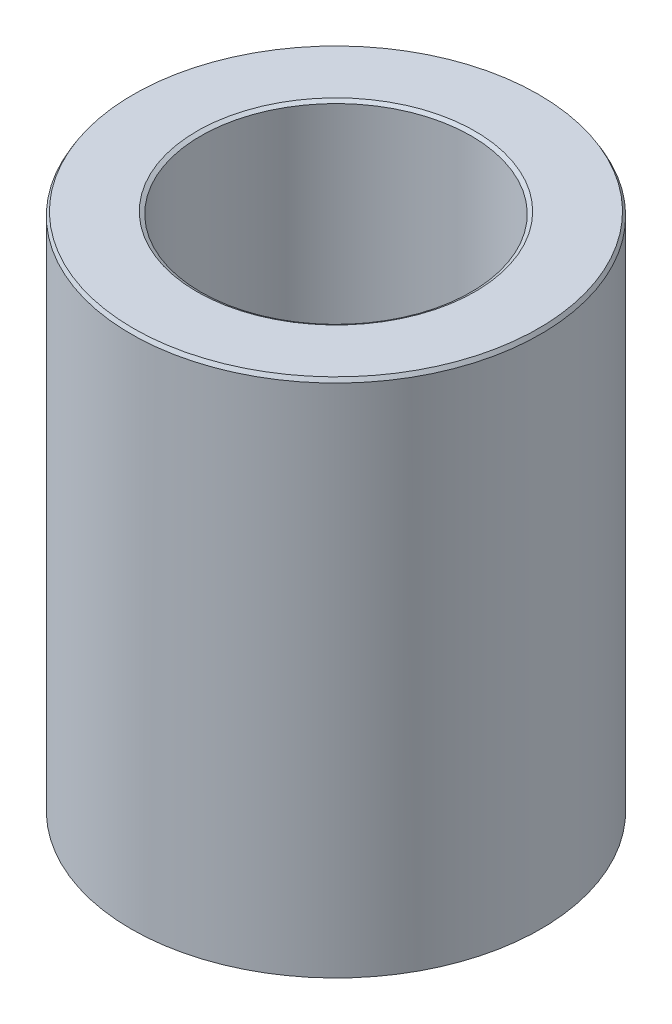
ISO-10303-21;
HEADER;
FILE_DESCRIPTION(('STEP AP214'),'2;1');
FILE_NAME('part.step','',(''),(''),'','','');
FILE_SCHEMA(('AUTOMOTIVE_DESIGN { 1 0 10303 214 1 1 1 1 }'));
ENDSEC;
DATA;
#1=APPLICATION_CONTEXT('core data for automotive mechanical design processes');
#2=APPLICATION_PROTOCOL_DEFINITION('international standard','automotive_design',2000,#1);
#3=PRODUCT_CONTEXT('',#1,'mechanical');
#4=PRODUCT('Part','Part','',(#3));
#5=PRODUCT_RELATED_PRODUCT_CATEGORY('part','',(#4));
#6=PRODUCT_DEFINITION_FORMATION('','',#4);
#7=PRODUCT_DEFINITION_CONTEXT('part definition',#1,'design');
#8=PRODUCT_DEFINITION('design','',#6,#7);
#9=PRODUCT_DEFINITION_SHAPE('','',#8);
#10=(LENGTH_UNIT() NAMED_UNIT(*) SI_UNIT(.MILLI.,.METRE.));
#11=(NAMED_UNIT(*) PLANE_ANGLE_UNIT() SI_UNIT($,.RADIAN.));
#12=(NAMED_UNIT(*) SI_UNIT($,.STERADIAN.) SOLID_ANGLE_UNIT());
#13=UNCERTAINTY_MEASURE_WITH_UNIT(LENGTH_MEASURE(1.E-05),#10,'distance_accuracy_value','');
#14=(GEOMETRIC_REPRESENTATION_CONTEXT(3) GLOBAL_UNCERTAINTY_ASSIGNED_CONTEXT((#13)) GLOBAL_UNIT_ASSIGNED_CONTEXT((#10,
#11,#12)) REPRESENTATION_CONTEXT('',''));
#15=CARTESIAN_POINT('',(0.,0.,0.));
#16=DIRECTION('',(0.,0.,1.));
#17=DIRECTION('',(1.,0.,0.));
#18=AXIS2_PLACEMENT_3D('',#15,#16,#17);
#19=CARTESIAN_POINT('',(0.,101.789191785078,0.));
#20=DIRECTION('',(0.,-1.,0.));
#21=DIRECTION('',(0.,0.,-1.));
#22=AXIS2_PLACEMENT_3D('',#19,#20,#21);
#23=CYLINDRICAL_SURFACE('',#22,40.);
#24=CARTESIAN_POINT('',(0.,0.432289931129648,0.));
#25=DIRECTION('',(0.,1.,0.));
#26=DIRECTION('',(0.,0.,1.));
#27=AXIS2_PLACEMENT_3D('',#24,#25,#26);
#28=CIRCLE('',#27,40.);
#29=CARTESIAN_POINT('',(0.,0.432289931129634,-40.));
#30=VERTEX_POINT('',#29);
#31=EDGE_CURVE('E10',#30,#30,#28,.T.);
#32=CARTESIAN_POINT('',(0.,101.040443660761,0.));
#33=DIRECTION('',(0.,1.,0.));
#34=DIRECTION('',(0.,0.,1.));
#35=AXIS2_PLACEMENT_3D('',#32,#33,#34);
#36=CIRCLE('',#35,40.);
#37=CARTESIAN_POINT('',(0.,101.040443660761,-40.));
#38=VERTEX_POINT('',#37);
#39=EDGE_CURVE('E50',#38,#38,#36,.F.);
#40=CARTESIAN_POINT('',(0.,0.432289931129634,-40.));
#41=CARTESIAN_POINT('',(0.,1.48029153247996,-40.));
#42=CARTESIAN_POINT('',(0.,2.52829313383029,-40.));
#43=CARTESIAN_POINT('',(0.,4.62429633653095,-40.));
#44=CARTESIAN_POINT('',(0.,5.67229793788128,-40.));
#45=CARTESIAN_POINT('',(0.,7.76830114058193,-40.));
#46=CARTESIAN_POINT('',(0.,8.81630274193225,-40.));
#47=CARTESIAN_POINT('',(0.,10.9123059446329,-40.));
#48=CARTESIAN_POINT('',(0.,11.9603075459832,-40.));
#49=CARTESIAN_POINT('',(0.,14.0563107486839,-40.));
#50=CARTESIAN_POINT('',(0.,15.1043123500342,-40.));
#51=CARTESIAN_POINT('',(0.,17.2003155527349,-40.));
#52=CARTESIAN_POINT('',(0.,18.2483171540852,-40.));
#53=CARTESIAN_POINT('',(0.,20.3443203567859,-40.));
#54=CARTESIAN_POINT('',(0.,21.3923219581362,-40.));
#55=CARTESIAN_POINT('',(0.,23.4883251608368,-40.));
#56=CARTESIAN_POINT('',(0.,24.5363267621872,-40.));
#57=CARTESIAN_POINT('',(0.,26.6323299648878,-40.));
#58=CARTESIAN_POINT('',(0.,27.6803315662381,-40.));
#59=CARTESIAN_POINT('',(0.,29.7763347689388,-40.));
#60=CARTESIAN_POINT('',(0.,30.8243363702891,-40.));
#61=CARTESIAN_POINT('',(0.,32.9203395729898,-40.));
#62=CARTESIAN_POINT('',(0.,33.9683411743401,-40.));
#63=CARTESIAN_POINT('',(0.,36.0643443770408,-40.));
#64=CARTESIAN_POINT('',(0.,37.1123459783911,-40.));
#65=CARTESIAN_POINT('',(0.,39.2083491810917,-40.));
#66=CARTESIAN_POINT('',(0.,40.2563507824421,-40.));
#67=CARTESIAN_POINT('',(0.,42.3523539851427,-40.));
#68=CARTESIAN_POINT('',(0.,43.400355586493,-40.));
#69=CARTESIAN_POINT('',(0.,45.4963587891937,-40.));
#70=CARTESIAN_POINT('',(0.,46.544360390544,-40.));
#71=CARTESIAN_POINT('',(0.,48.6403635932447,-40.));
#72=CARTESIAN_POINT('',(0.,49.688365194595,-40.));
#73=CARTESIAN_POINT('',(0.,51.7843683972957,-40.));
#74=CARTESIAN_POINT('',(0.,52.832369998646,-40.));
#75=CARTESIAN_POINT('',(0.,54.9283732013466,-40.));
#76=CARTESIAN_POINT('',(0.,55.976374802697,-40.));
#77=CARTESIAN_POINT('',(0.,58.0723780053976,-40.));
#78=CARTESIAN_POINT('',(0.,59.120379606748,-40.));
#79=CARTESIAN_POINT('',(0.,61.2163828094486,-40.));
#80=CARTESIAN_POINT('',(0.,62.2643844107989,-40.));
#81=CARTESIAN_POINT('',(0.,64.3603876134996,-40.));
#82=CARTESIAN_POINT('',(0.,65.4083892148499,-40.));
#83=CARTESIAN_POINT('',(0.,67.5043924175506,-40.));
#84=CARTESIAN_POINT('',(0.,68.5523940189009,-40.));
#85=CARTESIAN_POINT('',(0.,70.6483972216015,-40.));
#86=CARTESIAN_POINT('',(0.,71.6963988229519,-40.));
#87=CARTESIAN_POINT('',(0.,73.7924020256525,-40.));
#88=CARTESIAN_POINT('',(0.,74.8404036270029,-40.));
#89=CARTESIAN_POINT('',(0.,76.9364068297035,-40.));
#90=CARTESIAN_POINT('',(0.,77.9844084310538,-40.));
#91=CARTESIAN_POINT('',(0.,80.0804116337545,-40.));
#92=CARTESIAN_POINT('',(0.,81.1284132351048,-40.));
#93=CARTESIAN_POINT('',(0.,83.2244164378055,-40.));
#94=CARTESIAN_POINT('',(0.,84.2724180391558,-40.));
#95=CARTESIAN_POINT('',(0.,86.3684212418565,-40.));
#96=CARTESIAN_POINT('',(0.,87.4164228432068,-40.));
#97=CARTESIAN_POINT('',(0.,89.5124260459074,-40.));
#98=CARTESIAN_POINT('',(0.,90.5604276472578,-40.));
#99=CARTESIAN_POINT('',(0.,92.6564308499584,-40.));
#100=CARTESIAN_POINT('',(0.,93.7044324513087,-40.));
#101=CARTESIAN_POINT('',(0.,95.8004356540094,-40.));
#102=CARTESIAN_POINT('',(0.,96.8484372553597,-40.));
#103=CARTESIAN_POINT('',(0.,98.9444404580604,-40.));
#104=CARTESIAN_POINT('',(0.,99.9924420594107,-40.));
#105=CARTESIAN_POINT('',(0.,101.040443660761,-40.));
#106=B_SPLINE_CURVE_WITH_KNOTS('',3,(#40,#41,#42,#43,#44,#45,#46,#47,#48,#49,#50,#51,#52,#53,
#54,#55,#56,#57,#58,#59,#60,#61,#62,#63,#64,#65,#66,#67,#68,#69,#70,#71,#72,#73,#74,#75,#76,#77,
#78,#79,#80,#81,#82,#83,#84,#85,#86,#87,#88,#89,#90,#91,#92,#93,#94,#95,#96,#97,#98,#99,#100,
#101,#102,#103,#104,#105),.UNSPECIFIED.,.F.,.F.,(4,2,2,2,2,2,2,2,2,2,2,2,2,2,2,2,2,2,2,2,2,2,2,
2,2,2,2,2,2,2,2,2,4),(0.,3.14400480405098,6.28800960810197,9.43201441215294,12.5760192162039,
15.7200240202549,18.8640288243059,22.0080336283569,25.1520384324078,28.2960432364588,
31.4400480405098,34.5840528445608,37.7280576486118,40.8720624526628,44.0160672567137,
47.1600720607647,50.3040768648157,53.4480816688667,56.5920864729177,59.7360912769687,
62.8800960810196,66.0241008850706,69.1681056891216,72.3121104931726,75.4561152972236,
78.6001201012745,81.7441249053255,84.8881297093765,88.0321345134275,91.1761393174785,
94.3201441215294,97.4641489255804,100.608153729631),.UNSPECIFIED.);
#107=EDGE_CURVE('BSEAM39',#30,#38,#106,.T.);
#108=ORIENTED_EDGE('',*,*,#31,.T.);
#109=ORIENTED_EDGE('',*,*,#39,.T.);
#110=ORIENTED_EDGE('',*,*,#107,.T.);
#111=ORIENTED_EDGE('',*,*,#107,.F.);
#112=EDGE_LOOP('',(#108,#110,#109,#111));
#113=FACE_BOUND('',#112,.T.);
#114=ADVANCED_FACE('F39',(#113),#23,.T.);
#115=CARTESIAN_POINT('',(0.,101.789191785078,0.));
#116=DIRECTION('',(0.,1.,0.));
#117=DIRECTION('',(0.,0.,1.));
#118=AXIS2_PLACEMENT_3D('',#115,#116,#117);
#119=PLANE('',#118);
#120=CARTESIAN_POINT('',(0.,101.789191785078,0.));
#121=DIRECTION('',(0.,1.,0.));
#122=DIRECTION('',(0.,0.,1.));
#123=AXIS2_PLACEMENT_3D('',#120,#121,#122);
#124=CIRCLE('',#123,27.1606508670038);
#125=CARTESIAN_POINT('',(0.,101.789191785078,27.1606508670038));
#126=VERTEX_POINT('',#125);
#127=EDGE_CURVE('E58',#126,#126,#124,.F.);
#128=ORIENTED_EDGE('',*,*,#127,.T.);
#129=EDGE_LOOP('',(#128));
#130=FACE_BOUND('',#129,.T.);
#131=CARTESIAN_POINT('',(0.,101.789191785078,0.));
#132=DIRECTION('',(0.,1.,0.));
#133=DIRECTION('',(0.,0.,1.));
#134=AXIS2_PLACEMENT_3D('',#131,#132,#133);
#135=CIRCLE('',#134,39.5677100688705);
#136=CARTESIAN_POINT('',(0.,101.789191785078,39.5677100688705));
#137=VERTEX_POINT('',#136);
#138=EDGE_CURVE('E61',#137,#137,#135,.T.);
#139=ORIENTED_EDGE('',*,*,#138,.T.);
#140=EDGE_LOOP('',(#139));
#141=FACE_BOUND('',#140,.T.);
#142=ADVANCED_FACE('F88',(#130,#141),#119,.T.);
#143=CARTESIAN_POINT('',(0.,0.,0.));
#144=DIRECTION('',(0.,1.,0.));
#145=DIRECTION('',(0.,0.,1.));
#146=AXIS2_PLACEMENT_3D('',#143,#144,#145);
#147=PLANE('',#146);
#148=CARTESIAN_POINT('',(0.,0.,0.));
#149=DIRECTION('',(0.,1.,0.));
#150=DIRECTION('',(0.,0.,1.));
#151=AXIS2_PLACEMENT_3D('',#148,#149,#150);
#152=CIRCLE('',#151,26.8441926738164);
#153=CARTESIAN_POINT('',(0.,0.,26.8441926738164));
#154=VERTEX_POINT('',#153);
#155=EDGE_CURVE('E51',#154,#154,#152,.T.);
#156=ORIENTED_EDGE('',*,*,#155,.T.);
#157=EDGE_LOOP('',(#156));
#158=FACE_BOUND('',#157,.T.);
#159=CARTESIAN_POINT('',(0.,0.,0.));
#160=DIRECTION('',(0.,1.,0.));
#161=DIRECTION('',(0.,0.,1.));
#162=AXIS2_PLACEMENT_3D('',#159,#160,#161);
#163=CIRCLE('',#162,39.251251875683);
#164=CARTESIAN_POINT('',(0.,0.,39.251251875683));
#165=VERTEX_POINT('',#164);
#166=EDGE_CURVE('E54',#165,#165,#163,.F.);
#167=ORIENTED_EDGE('',*,*,#166,.T.);
#168=EDGE_LOOP('',(#167));
#169=FACE_BOUND('',#168,.T.);
#170=ADVANCED_FACE('F83',(#158,#169),#147,.F.);
#171=CARTESIAN_POINT('',(0.,101.789191785078,0.));
#172=DIRECTION('',(0.,-1.,0.));
#173=DIRECTION('',(0.,0.,-1.));
#174=AXIS2_PLACEMENT_3D('',#171,#172,#173);
#175=CYLINDRICAL_SURFACE('',#174,26.4119027426868);
#176=CARTESIAN_POINT('',(0.,101.356901853948,0.));
#177=DIRECTION('',(0.,1.,0.));
#178=DIRECTION('',(0.,0.,1.));
#179=AXIS2_PLACEMENT_3D('',#176,#177,#178);
#180=CIRCLE('',#179,26.4119027426868);
#181=CARTESIAN_POINT('',(0.,101.356901853948,-26.4119027426868));
#182=VERTEX_POINT('',#181);
#183=EDGE_CURVE('E67',#182,#182,#180,.T.);
#184=CARTESIAN_POINT('',(0.,0.748748124316939,0.));
#185=DIRECTION('',(0.,1.,0.));
#186=DIRECTION('',(0.,0.,1.));
#187=AXIS2_PLACEMENT_3D('',#184,#185,#186);
#188=CIRCLE('',#187,26.4119027426868);
#189=CARTESIAN_POINT('',(0.,0.748748124316925,-26.4119027426868));
#190=VERTEX_POINT('',#189);
#191=EDGE_CURVE('E69',#190,#190,#188,.F.);
#192=CARTESIAN_POINT('',(0.,101.356901853948,-26.4119027426868));
#193=CARTESIAN_POINT('',(0.,100.308900252598,-26.4119027426868));
#194=CARTESIAN_POINT('',(0.,99.2608986512475,-26.4119027426868));
#195=CARTESIAN_POINT('',(0.,97.1648954485468,-26.4119027426868));
#196=CARTESIAN_POINT('',(0.,96.1168938471965,-26.4119027426868));
#197=CARTESIAN_POINT('',(0.,94.0208906444959,-26.4119027426868));
#198=CARTESIAN_POINT('',(0.,92.9728890431455,-26.4119027426868));
#199=CARTESIAN_POINT('',(0.,90.8768858404449,-26.4119027426868));
#200=CARTESIAN_POINT('',(0.,89.8288842390945,-26.4119027426868));
#201=CARTESIAN_POINT('',(0.,87.7328810363939,-26.4119027426868));
#202=CARTESIAN_POINT('',(0.,86.6848794350436,-26.4119027426868));
#203=CARTESIAN_POINT('',(0.,84.5888762323429,-26.4119027426868));
#204=CARTESIAN_POINT('',(0.,83.5408746309926,-26.4119027426868));
#205=CARTESIAN_POINT('',(0.,81.444871428292,-26.4119027426868));
#206=CARTESIAN_POINT('',(0.,80.3968698269416,-26.4119027426868));
#207=CARTESIAN_POINT('',(0.,78.300866624241,-26.4119027426868));
#208=CARTESIAN_POINT('',(0.,77.2528650228906,-26.4119027426868));
#209=CARTESIAN_POINT('',(0.,75.15686182019,-26.4119027426868));
#210=CARTESIAN_POINT('',(0.,74.1088602188397,-26.4119027426868));
#211=CARTESIAN_POINT('',(0.,72.012857016139,-26.4119027426868));
#212=CARTESIAN_POINT('',(0.,70.9648554147887,-26.4119027426868));
#213=CARTESIAN_POINT('',(0.,68.868852212088,-26.4119027426868));
#214=CARTESIAN_POINT('',(0.,67.8208506107377,-26.4119027426868));
#215=CARTESIAN_POINT('',(0.,65.7248474080371,-26.4119027426868));
#216=CARTESIAN_POINT('',(0.,64.6768458066868,-26.4119027426868));
#217=CARTESIAN_POINT('',(0.,62.5808426039861,-26.4119027426868));
#218=CARTESIAN_POINT('',(0.,61.5328410026358,-26.4119027426868));
#219=CARTESIAN_POINT('',(0.,59.4368377999351,-26.4119027426868));
#220=CARTESIAN_POINT('',(0.,58.3888361985848,-26.4119027426868));
#221=CARTESIAN_POINT('',(0.,56.2928329958842,-26.4119027426868));
#222=CARTESIAN_POINT('',(0.,55.2448313945338,-26.4119027426868));
#223=CARTESIAN_POINT('',(0.,53.1488281918332,-26.4119027426868));
#224=CARTESIAN_POINT('',(0.,52.1008265904829,-26.4119027426868));
#225=CARTESIAN_POINT('',(0.,50.0048233877822,-26.4119027426868));
#226=CARTESIAN_POINT('',(0.,48.9568217864319,-26.4119027426868));
#227=CARTESIAN_POINT('',(0.,46.8608185837312,-26.4119027426868));
#228=CARTESIAN_POINT('',(0.,45.8128169823809,-26.4119027426868));
#229=CARTESIAN_POINT('',(0.,43.7168137796803,-26.4119027426868));
#230=CARTESIAN_POINT('',(0.,42.6688121783299,-26.4119027426868));
#231=CARTESIAN_POINT('',(0.,40.5728089756293,-26.4119027426868));
#232=CARTESIAN_POINT('',(0.,39.524807374279,-26.4119027426868));
#233=CARTESIAN_POINT('',(0.,37.4288041715783,-26.4119027426868));
#234=CARTESIAN_POINT('',(0.,36.380802570228,-26.4119027426868));
#235=CARTESIAN_POINT('',(0.,34.2847993675273,-26.4119027426868));
#236=CARTESIAN_POINT('',(0.,33.236797766177,-26.4119027426868));
#237=CARTESIAN_POINT('',(0.,31.1407945634763,-26.4119027426868));
#238=CARTESIAN_POINT('',(0.,30.092792962126,-26.4119027426868));
#239=CARTESIAN_POINT('',(0.,27.9967897594254,-26.4119027426868));
#240=CARTESIAN_POINT('',(0.,26.9487881580751,-26.4119027426868));
#241=CARTESIAN_POINT('',(0.,24.8527849553744,-26.4119027426868));
#242=CARTESIAN_POINT('',(0.,23.8047833540241,-26.4119027426868));
#243=CARTESIAN_POINT('',(0.,21.7087801513234,-26.4119027426868));
#244=CARTESIAN_POINT('',(0.,20.6607785499731,-26.4119027426868));
#245=CARTESIAN_POINT('',(0.,18.5647753472725,-26.4119027426868));
#246=CARTESIAN_POINT('',(0.,17.5167737459221,-26.4119027426868));
#247=CARTESIAN_POINT('',(0.,15.4207705432215,-26.4119027426868));
#248=CARTESIAN_POINT('',(0.,14.3727689418712,-26.4119027426868));
#249=CARTESIAN_POINT('',(0.,12.2767657391705,-26.4119027426868));
#250=CARTESIAN_POINT('',(0.,11.2287641378202,-26.4119027426868));
#251=CARTESIAN_POINT('',(0.,9.13276093511953,-26.4119027426868));
#252=CARTESIAN_POINT('',(0.,8.0847593337692,-26.4119027426868));
#253=CARTESIAN_POINT('',(0.,5.98875613106855,-26.4119027426868));
#254=CARTESIAN_POINT('',(0.,4.94075452971822,-26.4119027426868));
#255=CARTESIAN_POINT('',(0.,2.84475132701757,-26.4119027426868));
#256=CARTESIAN_POINT('',(0.,1.79674972566725,-26.4119027426868));
#257=CARTESIAN_POINT('',(0.,0.748748124316925,-26.4119027426868));
#258=B_SPLINE_CURVE_WITH_KNOTS('',3,(#192,#193,#194,#195,#196,#197,#198,#199,#200,#201,#202,
#203,#204,#205,#206,#207,#208,#209,#210,#211,#212,#213,#214,#215,#216,#217,#218,#219,#220,#221,
#222,#223,#224,#225,#226,#227,#228,#229,#230,#231,#232,#233,#234,#235,#236,#237,#238,#239,#240,
#241,#242,#243,#244,#245,#246,#247,#248,#249,#250,#251,#252,#253,#254,#255,#256,#257),
.UNSPECIFIED.,.F.,.F.,(4,2,2,2,2,2,2,2,2,2,2,2,2,2,2,2,2,2,2,2,2,2,2,2,2,2,2,2,2,2,2,2,4),(0.,
3.14400480405097,6.28800960810194,9.43201441215291,12.5760192162039,15.7200240202549,
18.8640288243058,22.0080336283568,25.1520384324078,28.2960432364588,31.4400480405097,
34.5840528445607,37.7280576486117,40.8720624526627,44.0160672567136,47.1600720607646,
50.3040768648156,53.4480816688666,56.5920864729175,59.7360912769685,62.8800960810195,
66.0241008850705,69.1681056891214,72.3121104931724,75.4561152972234,78.6001201012744,
81.7441249053254,84.8881297093763,88.0321345134273,91.1761393174783,94.3201441215292,
97.4641489255802,100.608153729631),.UNSPECIFIED.);
#259=EDGE_CURVE('BSEAM71',#182,#190,#258,.T.);
#260=ORIENTED_EDGE('',*,*,#183,.T.);
#261=ORIENTED_EDGE('',*,*,#191,.T.);
#262=ORIENTED_EDGE('',*,*,#259,.T.);
#263=ORIENTED_EDGE('',*,*,#259,.F.);
#264=EDGE_LOOP('',(#260,#262,#261,#263));
#265=FACE_BOUND('',#264,.T.);
#266=ADVANCED_FACE('F71',(#265),#175,.F.);
#267=CARTESIAN_POINT('',(0.,101.356901853948,0.));
#268=DIRECTION('',(0.,1.,0.));
#269=DIRECTION('',(0.,0.,1.));
#270=AXIS2_PLACEMENT_3D('',#267,#268,#269);
#271=CONICAL_SURFACE('',#270,26.4119027426868,1.04719755119659);
#272=ORIENTED_EDGE('',*,*,#127,.F.);
#273=EDGE_LOOP('',(#272));
#274=FACE_BOUND('',#273,.T.);
#275=ORIENTED_EDGE('',*,*,#183,.F.);
#276=EDGE_LOOP('',(#275));
#277=FACE_BOUND('',#276,.T.);
#278=ADVANCED_FACE('F77',(#274,#277),#271,.F.);
#279=CARTESIAN_POINT('',(0.,0.,0.));
#280=DIRECTION('',(0.,-1.,0.));
#281=DIRECTION('',(0.,0.,-1.));
#282=AXIS2_PLACEMENT_3D('',#279,#280,#281);
#283=CONICAL_SURFACE('',#282,26.8441926738164,0.5235987755983);
#284=ORIENTED_EDGE('',*,*,#191,.F.);
#285=EDGE_LOOP('',(#284));
#286=FACE_BOUND('',#285,.T.);
#287=ORIENTED_EDGE('',*,*,#155,.F.);
#288=EDGE_LOOP('',(#287));
#289=FACE_BOUND('',#288,.T.);
#290=ADVANCED_FACE('F73',(#286,#289),#283,.F.);
#291=CARTESIAN_POINT('',(0.,0.432289931129648,0.));
#292=DIRECTION('',(0.,1.,0.));
#293=DIRECTION('',(0.,0.,1.));
#294=AXIS2_PLACEMENT_3D('',#291,#292,#293);
#295=CONICAL_SURFACE('',#294,40.,1.0471975511966);
#296=ORIENTED_EDGE('',*,*,#166,.F.);
#297=EDGE_LOOP('',(#296));
#298=FACE_BOUND('',#297,.T.);
#299=ORIENTED_EDGE('',*,*,#31,.F.);
#300=EDGE_LOOP('',(#299));
#301=FACE_BOUND('',#300,.T.);
#302=ADVANCED_FACE('F76',(#298,#301),#295,.T.);
#303=CARTESIAN_POINT('',(0.,101.789191785078,0.));
#304=DIRECTION('',(0.,-1.,0.));
#305=DIRECTION('',(0.,0.,-1.));
#306=AXIS2_PLACEMENT_3D('',#303,#304,#305);
#307=CONICAL_SURFACE('',#306,39.5677100688705,0.523598775598295);
#308=ORIENTED_EDGE('',*,*,#39,.F.);
#309=EDGE_LOOP('',(#308));
#310=FACE_BOUND('',#309,.T.);
#311=ORIENTED_EDGE('',*,*,#138,.F.);
#312=EDGE_LOOP('',(#311));
#313=FACE_BOUND('',#312,.T.);
#314=ADVANCED_FACE('F45',(#310,#313),#307,.T.);
#315=CLOSED_SHELL('',(#114,#142,#170,#266,#278,#290,#302,#314));
#316=MANIFOLD_SOLID_BREP('B2',#315);
#317=ADVANCED_BREP_SHAPE_REPRESENTATION('',(#18,#316),#14);
#318=SHAPE_DEFINITION_REPRESENTATION(#9,#317);
ENDSEC;
END-ISO-10303-21;
